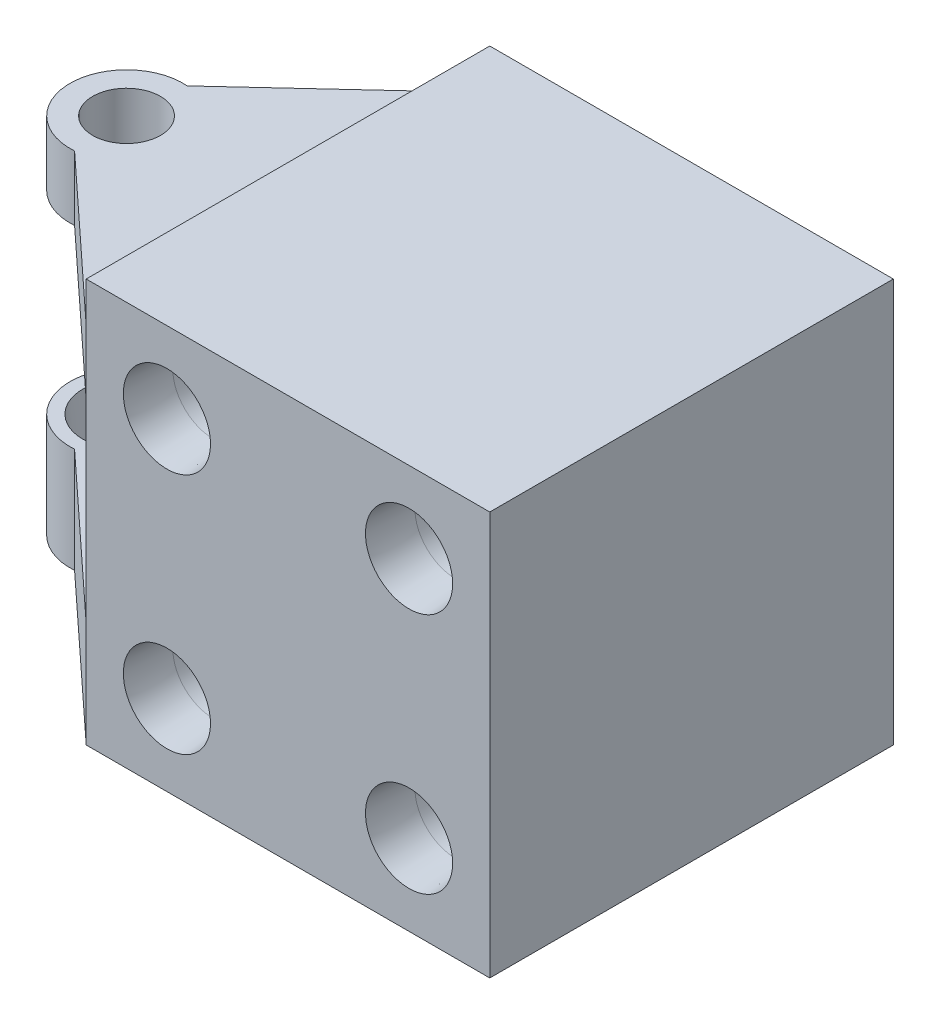
ISO-10303-21;
HEADER;
FILE_DESCRIPTION(('STEP AP214'),'2;1');
FILE_NAME('part.step','',(''),(''),'','','');
FILE_SCHEMA(('AUTOMOTIVE_DESIGN { 1 0 10303 214 1 1 1 1 }'));
ENDSEC;
DATA;
#1=APPLICATION_CONTEXT('core data for automotive mechanical design processes');
#2=APPLICATION_PROTOCOL_DEFINITION('international standard','automotive_design',2000,#1);
#3=PRODUCT_CONTEXT('',#1,'mechanical');
#4=PRODUCT('Part','Part','',(#3));
#5=PRODUCT_RELATED_PRODUCT_CATEGORY('part','',(#4));
#6=PRODUCT_DEFINITION_FORMATION('','',#4);
#7=PRODUCT_DEFINITION_CONTEXT('part definition',#1,'design');
#8=PRODUCT_DEFINITION('design','',#6,#7);
#9=PRODUCT_DEFINITION_SHAPE('','',#8);
#10=(LENGTH_UNIT() NAMED_UNIT(*) SI_UNIT(.MILLI.,.METRE.));
#11=(NAMED_UNIT(*) PLANE_ANGLE_UNIT() SI_UNIT($,.RADIAN.));
#12=(NAMED_UNIT(*) SI_UNIT($,.STERADIAN.) SOLID_ANGLE_UNIT());
#13=UNCERTAINTY_MEASURE_WITH_UNIT(LENGTH_MEASURE(1.E-05),#10,'distance_accuracy_value','');
#14=(GEOMETRIC_REPRESENTATION_CONTEXT(3) GLOBAL_UNCERTAINTY_ASSIGNED_CONTEXT((#13)) GLOBAL_UNIT_ASSIGNED_CONTEXT((#10,
#11,#12)) REPRESENTATION_CONTEXT('',''));
#15=CARTESIAN_POINT('',(0.,0.,0.));
#16=DIRECTION('',(0.,0.,1.));
#17=DIRECTION('',(1.,0.,0.));
#18=AXIS2_PLACEMENT_3D('',#15,#16,#17);
#19=CARTESIAN_POINT('',(-12.5,12.5,-12.5));
#20=DIRECTION('',(-1.,0.,0.));
#21=DIRECTION('',(0.,-1.,0.));
#22=AXIS2_PLACEMENT_3D('',#19,#20,#21);
#23=PLANE('',#22);
#24=DIRECTION('',(0.,-1.,0.));
#25=VECTOR('',#24,1.);
#26=CARTESIAN_POINT('',(-12.5,12.5,-12.5));
#27=LINE('',#26,#25);
#28=CARTESIAN_POINT('',(-12.5,12.5,-12.5));
#29=VERTEX_POINT('',#28);
#30=CARTESIAN_POINT('',(-12.5,10.,-12.5));
#31=VERTEX_POINT('',#30);
#32=EDGE_CURVE('E239',#29,#31,#27,.T.);
#33=ORIENTED_EDGE('',*,*,#32,.T.);
#34=DIRECTION('',(0.,0.,1.));
#35=VECTOR('',#34,1.);
#36=CARTESIAN_POINT('',(-12.5,10.,0.));
#37=LINE('',#36,#35);
#38=CARTESIAN_POINT('',(-12.5,10.,12.5));
#39=VERTEX_POINT('',#38);
#40=EDGE_CURVE('E176',#31,#39,#37,.T.);
#41=ORIENTED_EDGE('',*,*,#40,.T.);
#42=DIRECTION('',(0.,-1.,0.));
#43=VECTOR('',#42,1.);
#44=CARTESIAN_POINT('',(-12.5,12.5,12.5));
#45=LINE('',#44,#43);
#46=CARTESIAN_POINT('',(-12.5,12.5,12.5));
#47=VERTEX_POINT('',#46);
#48=EDGE_CURVE('E226',#47,#39,#45,.T.);
#49=ORIENTED_EDGE('',*,*,#48,.F.);
#50=DIRECTION('',(0.,0.,1.));
#51=VECTOR('',#50,1.);
#52=CARTESIAN_POINT('',(-12.5,12.5,-12.5));
#53=LINE('',#52,#51);
#54=EDGE_CURVE('E249',#29,#47,#53,.T.);
#55=ORIENTED_EDGE('',*,*,#54,.F.);
#56=EDGE_LOOP('',(#33,#41,#49,#55));
#57=FACE_BOUND('',#56,.T.);
#58=ADVANCED_FACE('F35',(#57),#23,.T.);
#59=CARTESIAN_POINT('',(7.49999999999999,-7.5,12.5));
#60=DIRECTION('',(0.,0.,1.));
#61=DIRECTION('',(1.,0.,0.));
#62=AXIS2_PLACEMENT_3D('',#59,#60,#61);
#63=CONICAL_SURFACE('',#62,2.7,0.0698131700797738);
#64=CARTESIAN_POINT('',(7.49999999999999,-7.5,9.63986674865748));
#65=DIRECTION('',(0.,0.,1.));
#66=DIRECTION('',(1.,0.,0.));
#67=AXIS2_PLACEMENT_3D('',#64,#65,#66);
#68=CIRCLE('',#67,2.49999999999999);
#69=CARTESIAN_POINT('',(9.99999999999998,-7.5,9.63986674865748));
#70=VERTEX_POINT('',#69);
#71=EDGE_CURVE('E11',#70,#70,#68,.T.);
#72=ORIENTED_EDGE('',*,*,#71,.F.);
#73=EDGE_LOOP('',(#72));
#74=FACE_BOUND('',#73,.T.);
#75=CARTESIAN_POINT('',(7.49999999999999,-7.5,12.5));
#76=DIRECTION('',(0.,0.,1.));
#77=DIRECTION('',(1.,0.,0.));
#78=AXIS2_PLACEMENT_3D('',#75,#76,#77);
#79=CIRCLE('',#78,2.7);
#80=CARTESIAN_POINT('',(10.2,-7.5,12.5));
#81=VERTEX_POINT('',#80);
#82=EDGE_CURVE('E260',#81,#81,#79,.T.);
#83=ORIENTED_EDGE('',*,*,#82,.T.);
#84=EDGE_LOOP('',(#83));
#85=FACE_BOUND('',#84,.T.);
#86=ADVANCED_FACE('F37',(#74,#85),#63,.F.);
#87=CARTESIAN_POINT('',(7.49999999999999,-7.5,12.5));
#88=DIRECTION('',(0.,0.,1.));
#89=DIRECTION('',(1.,0.,0.));
#90=AXIS2_PLACEMENT_3D('',#87,#88,#89);
#91=CYLINDRICAL_SURFACE('',#90,2.49999999999999);
#92=CARTESIAN_POINT('',(7.49999999999999,-7.5,2.50000000000001));
#93=DIRECTION('',(0.,0.,1.));
#94=DIRECTION('',(1.,0.,0.));
#95=AXIS2_PLACEMENT_3D('',#92,#93,#94);
#96=CIRCLE('',#95,2.49999999999999);
#97=CARTESIAN_POINT('',(9.99999999999998,-7.5,2.50000000000001));
#98=VERTEX_POINT('',#97);
#99=EDGE_CURVE('E44',#98,#98,#96,.T.);
#100=ORIENTED_EDGE('',*,*,#99,.F.);
#101=EDGE_LOOP('',(#100));
#102=FACE_BOUND('',#101,.T.);
#103=ORIENTED_EDGE('',*,*,#71,.T.);
#104=EDGE_LOOP('',(#103));
#105=FACE_BOUND('',#104,.T.);
#106=ADVANCED_FACE('F268',(#102,#105),#91,.F.);
#107=CARTESIAN_POINT('',(7.49999999999999,-7.5,2.50000000000001));
#108=DIRECTION('',(0.,0.,1.));
#109=DIRECTION('',(1.,0.,0.));
#110=AXIS2_PLACEMENT_3D('',#107,#108,#109);
#111=CONICAL_SURFACE('',#110,2.49999999999999,1.02974425867665);
#112=CARTESIAN_POINT('',(7.49999999999999,-7.5,0.997848452431099));
#113=VERTEX_POINT('',#112);
#114=VERTEX_LOOP('',#113);
#115=FACE_BOUND('',#114,.T.);
#116=ORIENTED_EDGE('',*,*,#99,.T.);
#117=EDGE_LOOP('',(#116));
#118=FACE_BOUND('',#117,.T.);
#119=ADVANCED_FACE('F266',(#115,#118),#111,.F.);
#120=CARTESIAN_POINT('',(7.49999999999999,7.5,12.5));
#121=DIRECTION('',(0.,0.,1.));
#122=DIRECTION('',(1.,0.,0.));
#123=AXIS2_PLACEMENT_3D('',#120,#121,#122);
#124=CONICAL_SURFACE('',#123,2.7,0.0698131700797738);
#125=CARTESIAN_POINT('',(7.49999999999999,7.5,9.63986674865748));
#126=DIRECTION('',(0.,0.,1.));
#127=DIRECTION('',(1.,0.,0.));
#128=AXIS2_PLACEMENT_3D('',#125,#126,#127);
#129=CIRCLE('',#128,2.49999999999999);
#130=CARTESIAN_POINT('',(9.99999999999998,7.5,9.63986674865748));
#131=VERTEX_POINT('',#130);
#132=EDGE_CURVE('E257',#131,#131,#129,.T.);
#133=ORIENTED_EDGE('',*,*,#132,.F.);
#134=EDGE_LOOP('',(#133));
#135=FACE_BOUND('',#134,.T.);
#136=CARTESIAN_POINT('',(7.49999999999999,7.5,12.5));
#137=DIRECTION('',(0.,0.,1.));
#138=DIRECTION('',(1.,0.,0.));
#139=AXIS2_PLACEMENT_3D('',#136,#137,#138);
#140=CIRCLE('',#139,2.7);
#141=CARTESIAN_POINT('',(10.2,7.5,12.5));
#142=VERTEX_POINT('',#141);
#143=EDGE_CURVE('E248',#142,#142,#140,.T.);
#144=ORIENTED_EDGE('',*,*,#143,.T.);
#145=EDGE_LOOP('',(#144));
#146=FACE_BOUND('',#145,.T.);
#147=ADVANCED_FACE('F567',(#135,#146),#124,.F.);
#148=CARTESIAN_POINT('',(7.49999999999999,7.5,12.5));
#149=DIRECTION('',(0.,0.,1.));
#150=DIRECTION('',(1.,0.,0.));
#151=AXIS2_PLACEMENT_3D('',#148,#149,#150);
#152=CYLINDRICAL_SURFACE('',#151,2.49999999999999);
#153=CARTESIAN_POINT('',(7.49999999999999,7.5,2.50000000000001));
#154=DIRECTION('',(0.,0.,1.));
#155=DIRECTION('',(1.,0.,0.));
#156=AXIS2_PLACEMENT_3D('',#153,#154,#155);
#157=CIRCLE('',#156,2.49999999999999);
#158=CARTESIAN_POINT('',(9.99999999999998,7.5,2.50000000000001));
#159=VERTEX_POINT('',#158);
#160=EDGE_CURVE('E254',#159,#159,#157,.T.);
#161=ORIENTED_EDGE('',*,*,#160,.F.);
#162=EDGE_LOOP('',(#161));
#163=FACE_BOUND('',#162,.T.);
#164=ORIENTED_EDGE('',*,*,#132,.T.);
#165=EDGE_LOOP('',(#164));
#166=FACE_BOUND('',#165,.T.);
#167=ADVANCED_FACE('F575',(#163,#166),#152,.F.);
#168=CARTESIAN_POINT('',(7.49999999999999,7.5,2.50000000000001));
#169=DIRECTION('',(0.,0.,1.));
#170=DIRECTION('',(1.,0.,0.));
#171=AXIS2_PLACEMENT_3D('',#168,#169,#170);
#172=CONICAL_SURFACE('',#171,2.49999999999999,1.02974425867665);
#173=CARTESIAN_POINT('',(7.49999999999999,7.5,0.997848452431099));
#174=VERTEX_POINT('',#173);
#175=VERTEX_LOOP('',#174);
#176=FACE_BOUND('',#175,.T.);
#177=ORIENTED_EDGE('',*,*,#160,.T.);
#178=EDGE_LOOP('',(#177));
#179=FACE_BOUND('',#178,.T.);
#180=ADVANCED_FACE('F584',(#176,#179),#172,.F.);
#181=CARTESIAN_POINT('',(12.5,12.5,-12.5));
#182=DIRECTION('',(1.,0.,0.));
#183=DIRECTION('',(0.,1.,0.));
#184=AXIS2_PLACEMENT_3D('',#181,#182,#183);
#185=PLANE('',#184);
#186=DIRECTION('',(0.,0.,1.));
#187=VECTOR('',#186,1.);
#188=CARTESIAN_POINT('',(12.5,12.5,-12.5));
#189=LINE('',#188,#187);
#190=CARTESIAN_POINT('',(12.5,12.5,-12.5));
#191=VERTEX_POINT('',#190);
#192=CARTESIAN_POINT('',(12.5,12.5,12.5));
#193=VERTEX_POINT('',#192);
#194=EDGE_CURVE('E245',#191,#193,#189,.T.);
#195=ORIENTED_EDGE('',*,*,#194,.T.);
#196=DIRECTION('',(0.,1.,0.));
#197=VECTOR('',#196,1.);
#198=CARTESIAN_POINT('',(12.5,12.5,12.5));
#199=LINE('',#198,#197);
#200=CARTESIAN_POINT('',(12.5,-12.5,12.5));
#201=VERTEX_POINT('',#200);
#202=EDGE_CURVE('E219',#201,#193,#199,.T.);
#203=ORIENTED_EDGE('',*,*,#202,.F.);
#204=DIRECTION('',(0.,0.,1.));
#205=VECTOR('',#204,1.);
#206=CARTESIAN_POINT('',(12.5,-12.5,-12.5));
#207=LINE('',#206,#205);
#208=CARTESIAN_POINT('',(12.5,-12.5,-12.5));
#209=VERTEX_POINT('',#208);
#210=EDGE_CURVE('E246',#209,#201,#207,.T.);
#211=ORIENTED_EDGE('',*,*,#210,.F.);
#212=DIRECTION('',(0.,1.,0.));
#213=VECTOR('',#212,1.);
#214=CARTESIAN_POINT('',(12.5,12.5,-12.5));
#215=LINE('',#214,#213);
#216=EDGE_CURVE('E232',#209,#191,#215,.T.);
#217=ORIENTED_EDGE('',*,*,#216,.T.);
#218=EDGE_LOOP('',(#195,#203,#211,#217));
#219=FACE_BOUND('',#218,.T.);
#220=ADVANCED_FACE('F315',(#219),#185,.T.);
#221=CARTESIAN_POINT('',(-12.5,-12.5,-12.5));
#222=DIRECTION('',(0.,-1.,0.));
#223=DIRECTION('',(0.,0.,-1.));
#224=AXIS2_PLACEMENT_3D('',#221,#222,#223);
#225=PLANE('',#224);
#226=CARTESIAN_POINT('',(-22.5,-12.5,0.));
#227=DIRECTION('',(0.,-1.,0.));
#228=DIRECTION('',(0.,0.,-1.));
#229=AXIS2_PLACEMENT_3D('',#226,#227,#228);
#230=CIRCLE('',#229,2.49999999999999);
#231=CARTESIAN_POINT('',(-22.5,-12.5,-2.49999999999999));
#232=VERTEX_POINT('',#231);
#233=EDGE_CURVE('E39',#232,#232,#230,.T.);
#234=ORIENTED_EDGE('',*,*,#233,.F.);
#235=EDGE_LOOP('',(#234));
#236=FACE_BOUND('',#235,.T.);
#237=ORIENTED_EDGE('',*,*,#210,.T.);
#238=DIRECTION('',(1.,0.,0.));
#239=VECTOR('',#238,1.);
#240=CARTESIAN_POINT('',(-12.5,-12.5,12.5));
#241=LINE('',#240,#239);
#242=CARTESIAN_POINT('',(-12.5,-12.5,12.5));
#243=VERTEX_POINT('',#242);
#244=EDGE_CURVE('E229',#243,#201,#241,.T.);
#245=ORIENTED_EDGE('',*,*,#244,.F.);
#246=DIRECTION('',(0.733760674018169,0.,0.679408031498305));
#247=VECTOR('',#246,1.);
#248=CARTESIAN_POINT('',(-12.0014771048745,-12.5,12.9615952732644));
#249=LINE('',#248,#247);
#250=CARTESIAN_POINT('',(-22.2311669128508,-12.5,3.48966026587888));
#251=VERTEX_POINT('',#250);
#252=EDGE_CURVE('E156',#251,#243,#249,.T.);
#253=ORIENTED_EDGE('',*,*,#252,.F.);
#254=CARTESIAN_POINT('',(-22.5,-12.5,0.));
#255=DIRECTION('',(0.,-1.,0.));
#256=DIRECTION('',(0.,0.,-1.));
#257=AXIS2_PLACEMENT_3D('',#254,#255,#256);
#258=CIRCLE('',#257,3.5);
#259=CARTESIAN_POINT('',(-22.2311669128508,-12.5,-3.48966026587888));
#260=VERTEX_POINT('',#259);
#261=EDGE_CURVE('E148',#260,#251,#258,.F.);
#262=ORIENTED_EDGE('',*,*,#261,.F.);
#263=DIRECTION('',(0.733760674018169,0.,-0.679408031498305));
#264=VECTOR('',#263,1.);
#265=CARTESIAN_POINT('',(-12.0014771048745,-12.5,-12.9615952732644));
#266=LINE('',#265,#264);
#267=CARTESIAN_POINT('',(-12.5,-12.5,-12.5));
#268=VERTEX_POINT('',#267);
#269=EDGE_CURVE('E135',#260,#268,#266,.T.);
#270=ORIENTED_EDGE('',*,*,#269,.T.);
#271=DIRECTION('',(1.,0.,0.));
#272=VECTOR('',#271,1.);
#273=CARTESIAN_POINT('',(-12.5,-12.5,-12.5));
#274=LINE('',#273,#272);
#275=EDGE_CURVE('E242',#268,#209,#274,.T.);
#276=ORIENTED_EDGE('',*,*,#275,.T.);
#277=EDGE_LOOP('',(#237,#245,#253,#262,#270,#276));
#278=FACE_BOUND('',#277,.T.);
#279=ADVANCED_FACE('F307',(#236,#278),#225,.T.);
#280=DIRECTION('',(0.,0.,1.));
#281=VECTOR('',#280,1.);
#282=CARTESIAN_POINT('',(-12.5,-6.,0.));
#283=LINE('',#282,#281);
#284=CARTESIAN_POINT('',(-12.5,-6.,-12.5));
#285=VERTEX_POINT('',#284);
#286=CARTESIAN_POINT('',(-12.5,-6.,12.5));
#287=VERTEX_POINT('',#286);
#288=EDGE_CURVE('E139',#285,#287,#283,.T.);
#289=ORIENTED_EDGE('',*,*,#288,.T.);
#290=CARTESIAN_POINT('',(-12.5,6.,12.5));
#291=VERTEX_POINT('',#290);
#292=EDGE_CURVE('E225',#291,#287,#45,.T.);
#293=ORIENTED_EDGE('',*,*,#292,.F.);
#294=DIRECTION('',(0.,0.,1.));
#295=VECTOR('',#294,1.);
#296=CARTESIAN_POINT('',(-12.5,6.,0.));
#297=LINE('',#296,#295);
#298=CARTESIAN_POINT('',(-12.5,6.,-12.5));
#299=VERTEX_POINT('',#298);
#300=EDGE_CURVE('E189',#299,#291,#297,.T.);
#301=ORIENTED_EDGE('',*,*,#300,.F.);
#302=EDGE_CURVE('E238',#299,#285,#27,.T.);
#303=ORIENTED_EDGE('',*,*,#302,.T.);
#304=EDGE_LOOP('',(#289,#293,#301,#303));
#305=FACE_BOUND('',#304,.T.);
#306=ADVANCED_FACE('F299',(#305),#23,.T.);
#307=CARTESIAN_POINT('',(-12.5,12.5,-12.5));
#308=DIRECTION('',(0.,1.,0.));
#309=DIRECTION('',(0.,0.,1.));
#310=AXIS2_PLACEMENT_3D('',#307,#308,#309);
#311=PLANE('',#310);
#312=ORIENTED_EDGE('',*,*,#54,.T.);
#313=DIRECTION('',(-1.,0.,0.));
#314=VECTOR('',#313,1.);
#315=CARTESIAN_POINT('',(-12.5,12.5,12.5));
#316=LINE('',#315,#314);
#317=EDGE_CURVE('E222',#193,#47,#316,.T.);
#318=ORIENTED_EDGE('',*,*,#317,.F.);
#319=ORIENTED_EDGE('',*,*,#194,.F.);
#320=DIRECTION('',(-1.,0.,0.));
#321=VECTOR('',#320,1.);
#322=CARTESIAN_POINT('',(-12.5,12.5,-12.5));
#323=LINE('',#322,#321);
#324=EDGE_CURVE('E235',#191,#29,#323,.T.);
#325=ORIENTED_EDGE('',*,*,#324,.T.);
#326=EDGE_LOOP('',(#312,#318,#319,#325));
#327=FACE_BOUND('',#326,.T.);
#328=ADVANCED_FACE('F291',(#327),#311,.T.);
#329=CARTESIAN_POINT('',(0.,0.,-12.5));
#330=DIRECTION('',(0.,0.,1.));
#331=DIRECTION('',(1.,0.,0.));
#332=AXIS2_PLACEMENT_3D('',#329,#330,#331);
#333=PLANE('',#332);
#334=ORIENTED_EDGE('',*,*,#216,.F.);
#335=ORIENTED_EDGE('',*,*,#275,.F.);
#336=DIRECTION('',(0.,1.,0.));
#337=VECTOR('',#336,1.);
#338=CARTESIAN_POINT('',(-12.5,-40.9121452903508,-12.5));
#339=LINE('',#338,#337);
#340=EDGE_CURVE('E164',#268,#285,#339,.T.);
#341=ORIENTED_EDGE('',*,*,#340,.T.);
#342=ORIENTED_EDGE('',*,*,#302,.F.);
#343=DIRECTION('',(0.,-1.,0.));
#344=VECTOR('',#343,1.);
#345=CARTESIAN_POINT('',(-12.5,10.,-12.5));
#346=LINE('',#345,#344);
#347=EDGE_CURVE('E182',#31,#299,#346,.T.);
#348=ORIENTED_EDGE('',*,*,#347,.F.);
#349=ORIENTED_EDGE('',*,*,#32,.F.);
#350=ORIENTED_EDGE('',*,*,#324,.F.);
#351=EDGE_LOOP('',(#334,#335,#341,#342,#348,#349,#350));
#352=FACE_BOUND('',#351,.T.);
#353=ADVANCED_FACE('F280',(#352),#333,.F.);
#354=CARTESIAN_POINT('',(0.,0.,12.5));
#355=DIRECTION('',(0.,0.,1.));
#356=DIRECTION('',(1.,0.,0.));
#357=AXIS2_PLACEMENT_3D('',#354,#355,#356);
#358=PLANE('',#357);
#359=CARTESIAN_POINT('',(-7.50000000000001,-7.5,12.5));
#360=DIRECTION('',(0.,0.,1.));
#361=DIRECTION('',(1.,0.,0.));
#362=AXIS2_PLACEMENT_3D('',#359,#360,#361);
#363=CIRCLE('',#362,2.7);
#364=CARTESIAN_POINT('',(-4.80000000000001,-7.5,12.5));
#365=VERTEX_POINT('',#364);
#366=EDGE_CURVE('E201',#365,#365,#363,.T.);
#367=ORIENTED_EDGE('',*,*,#366,.F.);
#368=EDGE_LOOP('',(#367));
#369=FACE_BOUND('',#368,.T.);
#370=CARTESIAN_POINT('',(-7.50000000000001,7.5,12.5));
#371=DIRECTION('',(0.,0.,1.));
#372=DIRECTION('',(1.,0.,0.));
#373=AXIS2_PLACEMENT_3D('',#370,#371,#372);
#374=CIRCLE('',#373,2.7);
#375=CARTESIAN_POINT('',(-4.80000000000001,7.5,12.5));
#376=VERTEX_POINT('',#375);
#377=EDGE_CURVE('E210',#376,#376,#374,.T.);
#378=ORIENTED_EDGE('',*,*,#377,.F.);
#379=EDGE_LOOP('',(#378));
#380=FACE_BOUND('',#379,.T.);
#381=ORIENTED_EDGE('',*,*,#202,.T.);
#382=ORIENTED_EDGE('',*,*,#317,.T.);
#383=ORIENTED_EDGE('',*,*,#48,.T.);
#384=DIRECTION('',(0.,-1.,0.));
#385=VECTOR('',#384,1.);
#386=CARTESIAN_POINT('',(-12.5,10.,12.5));
#387=LINE('',#386,#385);
#388=EDGE_CURVE('E51',#39,#291,#387,.T.);
#389=ORIENTED_EDGE('',*,*,#388,.T.);
#390=ORIENTED_EDGE('',*,*,#292,.T.);
#391=DIRECTION('',(0.,1.,0.));
#392=VECTOR('',#391,1.);
#393=CARTESIAN_POINT('',(-12.5,-40.9121452903508,12.5));
#394=LINE('',#393,#392);
#395=EDGE_CURVE('E162',#243,#287,#394,.T.);
#396=ORIENTED_EDGE('',*,*,#395,.F.);
#397=ORIENTED_EDGE('',*,*,#244,.T.);
#398=EDGE_LOOP('',(#381,#382,#383,#389,#390,#396,#397));
#399=FACE_BOUND('',#398,.T.);
#400=ORIENTED_EDGE('',*,*,#143,.F.);
#401=EDGE_LOOP('',(#400));
#402=FACE_BOUND('',#401,.T.);
#403=ORIENTED_EDGE('',*,*,#82,.F.);
#404=EDGE_LOOP('',(#403));
#405=FACE_BOUND('',#404,.T.);
#406=ADVANCED_FACE('F277',(#369,#380,#399,#402,#405),#358,.T.);
#407=CARTESIAN_POINT('',(-7.50000000000001,7.5,2.50000000000001));
#408=DIRECTION('',(0.,0.,1.));
#409=DIRECTION('',(1.,0.,0.));
#410=AXIS2_PLACEMENT_3D('',#407,#408,#409);
#411=CONICAL_SURFACE('',#410,2.49999999999999,1.02974425867665);
#412=CARTESIAN_POINT('',(-7.50000000000001,7.5,0.997848452431099));
#413=VERTEX_POINT('',#412);
#414=VERTEX_LOOP('',#413);
#415=FACE_BOUND('',#414,.T.);
#416=CARTESIAN_POINT('',(-7.50000000000001,7.5,2.50000000000001));
#417=DIRECTION('',(0.,0.,1.));
#418=DIRECTION('',(1.,0.,0.));
#419=AXIS2_PLACEMENT_3D('',#416,#417,#418);
#420=CIRCLE('',#419,2.49999999999999);
#421=CARTESIAN_POINT('',(-5.00000000000002,7.5,2.50000000000001));
#422=VERTEX_POINT('',#421);
#423=EDGE_CURVE('E216',#422,#422,#420,.T.);
#424=ORIENTED_EDGE('',*,*,#423,.T.);
#425=EDGE_LOOP('',(#424));
#426=FACE_BOUND('',#425,.T.);
#427=ADVANCED_FACE('F279',(#415,#426),#411,.F.);
#428=CARTESIAN_POINT('',(-7.50000000000001,7.5,12.5));
#429=DIRECTION('',(0.,0.,1.));
#430=DIRECTION('',(1.,0.,0.));
#431=AXIS2_PLACEMENT_3D('',#428,#429,#430);
#432=CYLINDRICAL_SURFACE('',#431,2.49999999999999);
#433=ORIENTED_EDGE('',*,*,#423,.F.);
#434=EDGE_LOOP('',(#433));
#435=FACE_BOUND('',#434,.T.);
#436=CARTESIAN_POINT('',(-7.50000000000001,7.5,9.63986674865748));
#437=DIRECTION('',(0.,0.,1.));
#438=DIRECTION('',(1.,0.,0.));
#439=AXIS2_PLACEMENT_3D('',#436,#437,#438);
#440=CIRCLE('',#439,2.49999999999999);
#441=CARTESIAN_POINT('',(-5.00000000000002,7.5,9.63986674865748));
#442=VERTEX_POINT('',#441);
#443=EDGE_CURVE('E213',#442,#442,#440,.T.);
#444=ORIENTED_EDGE('',*,*,#443,.T.);
#445=EDGE_LOOP('',(#444));
#446=FACE_BOUND('',#445,.T.);
#447=ADVANCED_FACE('F288',(#435,#446),#432,.F.);
#448=CARTESIAN_POINT('',(-7.50000000000001,7.5,12.5));
#449=DIRECTION('',(0.,0.,1.));
#450=DIRECTION('',(1.,0.,0.));
#451=AXIS2_PLACEMENT_3D('',#448,#449,#450);
#452=CONICAL_SURFACE('',#451,2.7,0.0698131700797738);
#453=ORIENTED_EDGE('',*,*,#443,.F.);
#454=EDGE_LOOP('',(#453));
#455=FACE_BOUND('',#454,.T.);
#456=ORIENTED_EDGE('',*,*,#377,.T.);
#457=EDGE_LOOP('',(#456));
#458=FACE_BOUND('',#457,.T.);
#459=ADVANCED_FACE('F375',(#455,#458),#452,.F.);
#460=CARTESIAN_POINT('',(-7.50000000000001,-7.5,2.50000000000001));
#461=DIRECTION('',(0.,0.,1.));
#462=DIRECTION('',(1.,0.,0.));
#463=AXIS2_PLACEMENT_3D('',#460,#461,#462);
#464=CONICAL_SURFACE('',#463,2.49999999999999,1.02974425867665);
#465=CARTESIAN_POINT('',(-7.50000000000001,-7.5,0.997848452431099));
#466=VERTEX_POINT('',#465);
#467=VERTEX_LOOP('',#466);
#468=FACE_BOUND('',#467,.T.);
#469=CARTESIAN_POINT('',(-7.50000000000001,-7.5,2.50000000000001));
#470=DIRECTION('',(0.,0.,1.));
#471=DIRECTION('',(1.,0.,0.));
#472=AXIS2_PLACEMENT_3D('',#469,#470,#471);
#473=CIRCLE('',#472,2.49999999999999);
#474=CARTESIAN_POINT('',(-5.00000000000002,-7.5,2.50000000000001));
#475=VERTEX_POINT('',#474);
#476=EDGE_CURVE('E207',#475,#475,#473,.T.);
#477=ORIENTED_EDGE('',*,*,#476,.T.);
#478=EDGE_LOOP('',(#477));
#479=FACE_BOUND('',#478,.T.);
#480=ADVANCED_FACE('F371',(#468,#479),#464,.F.);
#481=CARTESIAN_POINT('',(-7.50000000000001,-7.5,12.5));
#482=DIRECTION('',(0.,0.,1.));
#483=DIRECTION('',(1.,0.,0.));
#484=AXIS2_PLACEMENT_3D('',#481,#482,#483);
#485=CYLINDRICAL_SURFACE('',#484,2.49999999999999);
#486=ORIENTED_EDGE('',*,*,#476,.F.);
#487=EDGE_LOOP('',(#486));
#488=FACE_BOUND('',#487,.T.);
#489=CARTESIAN_POINT('',(-7.50000000000001,-7.5,9.63986674865748));
#490=DIRECTION('',(0.,0.,1.));
#491=DIRECTION('',(1.,0.,0.));
#492=AXIS2_PLACEMENT_3D('',#489,#490,#491);
#493=CIRCLE('',#492,2.49999999999999);
#494=CARTESIAN_POINT('',(-5.00000000000002,-7.5,9.63986674865748));
#495=VERTEX_POINT('',#494);
#496=EDGE_CURVE('E204',#495,#495,#493,.T.);
#497=ORIENTED_EDGE('',*,*,#496,.T.);
#498=EDGE_LOOP('',(#497));
#499=FACE_BOUND('',#498,.T.);
#500=ADVANCED_FACE('F367',(#488,#499),#485,.F.);
#501=CARTESIAN_POINT('',(-7.50000000000001,-7.5,12.5));
#502=DIRECTION('',(0.,0.,1.));
#503=DIRECTION('',(1.,0.,0.));
#504=AXIS2_PLACEMENT_3D('',#501,#502,#503);
#505=CONICAL_SURFACE('',#504,2.7,0.0698131700797738);
#506=ORIENTED_EDGE('',*,*,#496,.F.);
#507=EDGE_LOOP('',(#506));
#508=FACE_BOUND('',#507,.T.);
#509=ORIENTED_EDGE('',*,*,#366,.T.);
#510=EDGE_LOOP('',(#509));
#511=FACE_BOUND('',#510,.T.);
#512=ADVANCED_FACE('F364',(#508,#511),#505,.F.);
#513=CARTESIAN_POINT('',(-12.0014771048745,10.,-12.9615952732644));
#514=DIRECTION('',(-0.679408031498305,0.,-0.733760674018169));
#515=DIRECTION('',(-0.733760674018169,0.,0.679408031498305));
#516=AXIS2_PLACEMENT_3D('',#513,#514,#515);
#517=PLANE('',#516);
#518=DIRECTION('',(0.733760674018169,0.,-0.679408031498305));
#519=VECTOR('',#518,1.);
#520=CARTESIAN_POINT('',(-12.0014771048745,6.,-12.9615952732644));
#521=LINE('',#520,#519);
#522=CARTESIAN_POINT('',(-22.2311669128508,6.,-3.48966026587888));
#523=VERTEX_POINT('',#522);
#524=EDGE_CURVE('E168',#523,#299,#521,.T.);
#525=ORIENTED_EDGE('',*,*,#524,.F.);
#526=DIRECTION('',(0.,-1.,0.));
#527=VECTOR('',#526,1.);
#528=CARTESIAN_POINT('',(-22.2311669128508,10.,-3.48966026587888));
#529=LINE('',#528,#527);
#530=CARTESIAN_POINT('',(-22.2311669128508,10.,-3.48966026587888));
#531=VERTEX_POINT('',#530);
#532=EDGE_CURVE('E199',#531,#523,#529,.T.);
#533=ORIENTED_EDGE('',*,*,#532,.F.);
#534=DIRECTION('',(0.733760674018169,0.,-0.679408031498305));
#535=VECTOR('',#534,1.);
#536=CARTESIAN_POINT('',(-12.0014771048745,10.,-12.9615952732644));
#537=LINE('',#536,#535);
#538=EDGE_CURVE('E169',#531,#31,#537,.T.);
#539=ORIENTED_EDGE('',*,*,#538,.T.);
#540=ORIENTED_EDGE('',*,*,#347,.T.);
#541=EDGE_LOOP('',(#525,#533,#539,#540));
#542=FACE_BOUND('',#541,.T.);
#543=ADVANCED_FACE('F339',(#542),#517,.T.);
#544=CARTESIAN_POINT('',(-22.5,10.,0.));
#545=DIRECTION('',(0.,-1.,0.));
#546=DIRECTION('',(0.,0.,-1.));
#547=AXIS2_PLACEMENT_3D('',#544,#545,#546);
#548=CYLINDRICAL_SURFACE('',#547,3.5);
#549=CARTESIAN_POINT('',(-22.5,6.,0.));
#550=DIRECTION('',(0.,1.,0.));
#551=DIRECTION('',(0.,0.,1.));
#552=AXIS2_PLACEMENT_3D('',#549,#550,#551);
#553=CIRCLE('',#552,3.5);
#554=CARTESIAN_POINT('',(-22.2311669128508,6.,3.48966026587888));
#555=VERTEX_POINT('',#554);
#556=EDGE_CURVE('E185',#523,#555,#553,.T.);
#557=ORIENTED_EDGE('',*,*,#556,.T.);
#558=DIRECTION('',(0.,-1.,0.));
#559=VECTOR('',#558,1.);
#560=CARTESIAN_POINT('',(-22.2311669128508,10.,3.48966026587888));
#561=LINE('',#560,#559);
#562=CARTESIAN_POINT('',(-22.2311669128508,10.,3.48966026587888));
#563=VERTEX_POINT('',#562);
#564=EDGE_CURVE('E196',#563,#555,#561,.T.);
#565=ORIENTED_EDGE('',*,*,#564,.F.);
#566=CARTESIAN_POINT('',(-22.5,10.,0.));
#567=DIRECTION('',(0.,1.,0.));
#568=DIRECTION('',(0.,0.,1.));
#569=AXIS2_PLACEMENT_3D('',#566,#567,#568);
#570=CIRCLE('',#569,3.5);
#571=EDGE_CURVE('E171',#531,#563,#570,.T.);
#572=ORIENTED_EDGE('',*,*,#571,.F.);
#573=ORIENTED_EDGE('',*,*,#532,.T.);
#574=EDGE_LOOP('',(#557,#565,#572,#573));
#575=FACE_BOUND('',#574,.T.);
#576=ADVANCED_FACE('F347',(#575),#548,.T.);
#577=CARTESIAN_POINT('',(-12.0014771048745,10.,12.9615952732644));
#578=DIRECTION('',(0.679408031498305,0.,-0.733760674018169));
#579=DIRECTION('',(-0.733760674018169,0.,-0.679408031498305));
#580=AXIS2_PLACEMENT_3D('',#577,#578,#579);
#581=PLANE('',#580);
#582=DIRECTION('',(0.733760674018169,0.,0.679408031498305));
#583=VECTOR('',#582,1.);
#584=CARTESIAN_POINT('',(-12.0014771048745,6.,12.9615952732644));
#585=LINE('',#584,#583);
#586=EDGE_CURVE('E187',#555,#291,#585,.T.);
#587=ORIENTED_EDGE('',*,*,#586,.T.);
#588=ORIENTED_EDGE('',*,*,#388,.F.);
#589=DIRECTION('',(0.733760674018169,0.,0.679408031498305));
#590=VECTOR('',#589,1.);
#591=CARTESIAN_POINT('',(-12.0014771048745,10.,12.9615952732644));
#592=LINE('',#591,#590);
#593=EDGE_CURVE('E174',#563,#39,#592,.T.);
#594=ORIENTED_EDGE('',*,*,#593,.F.);
#595=ORIENTED_EDGE('',*,*,#564,.T.);
#596=EDGE_LOOP('',(#587,#588,#594,#595));
#597=FACE_BOUND('',#596,.T.);
#598=ADVANCED_FACE('F349',(#597),#581,.F.);
#599=CARTESIAN_POINT('',(-22.5,10.,0.));
#600=DIRECTION('',(0.,-1.,0.));
#601=DIRECTION('',(0.,0.,-1.));
#602=AXIS2_PLACEMENT_3D('',#599,#600,#601);
#603=CYLINDRICAL_SURFACE('',#602,2.1);
#604=CARTESIAN_POINT('',(-22.5,10.,0.));
#605=DIRECTION('',(0.,1.,0.));
#606=DIRECTION('',(0.,0.,1.));
#607=AXIS2_PLACEMENT_3D('',#604,#605,#606);
#608=CIRCLE('',#607,2.1);
#609=CARTESIAN_POINT('',(-22.5,10.,2.1));
#610=VERTEX_POINT('',#609);
#611=EDGE_CURVE('E179',#610,#610,#608,.T.);
#612=ORIENTED_EDGE('',*,*,#611,.T.);
#613=EDGE_LOOP('',(#612));
#614=FACE_BOUND('',#613,.T.);
#615=CARTESIAN_POINT('',(-22.5,6.,0.));
#616=DIRECTION('',(0.,1.,0.));
#617=DIRECTION('',(0.,0.,1.));
#618=AXIS2_PLACEMENT_3D('',#615,#616,#617);
#619=CIRCLE('',#618,2.1);
#620=CARTESIAN_POINT('',(-22.5,6.,2.1));
#621=VERTEX_POINT('',#620);
#622=EDGE_CURVE('E172',#621,#621,#619,.T.);
#623=ORIENTED_EDGE('',*,*,#622,.F.);
#624=EDGE_LOOP('',(#623));
#625=FACE_BOUND('',#624,.T.);
#626=ADVANCED_FACE('F351',(#614,#625),#603,.F.);
#627=CARTESIAN_POINT('',(0.,10.,0.));
#628=DIRECTION('',(0.,1.,0.));
#629=DIRECTION('',(0.,0.,1.));
#630=AXIS2_PLACEMENT_3D('',#627,#628,#629);
#631=PLANE('',#630);
#632=ORIENTED_EDGE('',*,*,#538,.F.);
#633=ORIENTED_EDGE('',*,*,#571,.T.);
#634=ORIENTED_EDGE('',*,*,#593,.T.);
#635=ORIENTED_EDGE('',*,*,#40,.F.);
#636=EDGE_LOOP('',(#632,#633,#634,#635));
#637=FACE_BOUND('',#636,.T.);
#638=ORIENTED_EDGE('',*,*,#611,.F.);
#639=EDGE_LOOP('',(#638));
#640=FACE_BOUND('',#639,.T.);
#641=ADVANCED_FACE('F333',(#637,#640),#631,.T.);
#642=CARTESIAN_POINT('',(0.,6.,0.));
#643=DIRECTION('',(0.,1.,0.));
#644=DIRECTION('',(0.,0.,1.));
#645=AXIS2_PLACEMENT_3D('',#642,#643,#644);
#646=PLANE('',#645);
#647=ORIENTED_EDGE('',*,*,#524,.T.);
#648=ORIENTED_EDGE('',*,*,#300,.T.);
#649=ORIENTED_EDGE('',*,*,#586,.F.);
#650=ORIENTED_EDGE('',*,*,#556,.F.);
#651=EDGE_LOOP('',(#647,#648,#649,#650));
#652=FACE_BOUND('',#651,.T.);
#653=ORIENTED_EDGE('',*,*,#622,.T.);
#654=EDGE_LOOP('',(#653));
#655=FACE_BOUND('',#654,.T.);
#656=ADVANCED_FACE('F342',(#652,#655),#646,.F.);
#657=CARTESIAN_POINT('',(0.,-6.,0.));
#658=DIRECTION('',(0.,1.,0.));
#659=DIRECTION('',(0.,0.,1.));
#660=AXIS2_PLACEMENT_3D('',#657,#658,#659);
#661=PLANE('',#660);
#662=CARTESIAN_POINT('',(-22.5,-6.,0.));
#663=DIRECTION('',(0.,1.,0.));
#664=DIRECTION('',(0.,0.,1.));
#665=AXIS2_PLACEMENT_3D('',#662,#663,#664);
#666=CIRCLE('',#665,2.7);
#667=CARTESIAN_POINT('',(-22.5,-6.,2.7));
#668=VERTEX_POINT('',#667);
#669=EDGE_CURVE('E627',#668,#668,#666,.T.);
#670=ORIENTED_EDGE('',*,*,#669,.F.);
#671=EDGE_LOOP('',(#670));
#672=FACE_BOUND('',#671,.T.);
#673=CARTESIAN_POINT('',(-22.5,-6.,0.));
#674=DIRECTION('',(0.,1.,0.));
#675=DIRECTION('',(0.,0.,1.));
#676=AXIS2_PLACEMENT_3D('',#673,#674,#675);
#677=CIRCLE('',#676,3.5);
#678=CARTESIAN_POINT('',(-22.2311669128508,-6.,-3.48966026587888));
#679=VERTEX_POINT('',#678);
#680=CARTESIAN_POINT('',(-22.2311669128508,-6.,3.48966026587888));
#681=VERTEX_POINT('',#680);
#682=EDGE_CURVE('E145',#679,#681,#677,.T.);
#683=ORIENTED_EDGE('',*,*,#682,.T.);
#684=DIRECTION('',(0.733760674018169,0.,0.679408031498305));
#685=VECTOR('',#684,1.);
#686=CARTESIAN_POINT('',(-12.0014771048745,-6.,12.9615952732644));
#687=LINE('',#686,#685);
#688=EDGE_CURVE('E154',#681,#287,#687,.T.);
#689=ORIENTED_EDGE('',*,*,#688,.T.);
#690=ORIENTED_EDGE('',*,*,#288,.F.);
#691=DIRECTION('',(0.733760674018169,0.,-0.679408031498305));
#692=VECTOR('',#691,1.);
#693=CARTESIAN_POINT('',(-12.0014771048745,-6.,-12.9615952732644));
#694=LINE('',#693,#692);
#695=EDGE_CURVE('E133',#679,#285,#694,.T.);
#696=ORIENTED_EDGE('',*,*,#695,.F.);
#697=EDGE_LOOP('',(#683,#689,#690,#696));
#698=FACE_BOUND('',#697,.T.);
#699=ADVANCED_FACE('F143',(#672,#698),#661,.T.);
#700=CARTESIAN_POINT('',(-12.0014771048745,-40.9121452903508,12.9615952732644));
#701=DIRECTION('',(-0.679408031498305,0.,0.733760674018169));
#702=DIRECTION('',(0.733760674018169,0.,0.679408031498305));
#703=AXIS2_PLACEMENT_3D('',#700,#701,#702);
#704=PLANE('',#703);
#705=DIRECTION('',(0.,1.,0.));
#706=VECTOR('',#705,1.);
#707=CARTESIAN_POINT('',(-22.2311669128508,-40.9121452903508,3.48966026587888));
#708=LINE('',#707,#706);
#709=EDGE_CURVE('E152',#251,#681,#708,.T.);
#710=ORIENTED_EDGE('',*,*,#709,.F.);
#711=ORIENTED_EDGE('',*,*,#252,.T.);
#712=ORIENTED_EDGE('',*,*,#395,.T.);
#713=ORIENTED_EDGE('',*,*,#688,.F.);
#714=EDGE_LOOP('',(#710,#711,#712,#713));
#715=FACE_BOUND('',#714,.T.);
#716=ADVANCED_FACE('F461',(#715),#704,.T.);
#717=CARTESIAN_POINT('',(-12.0014771048745,-40.9121452903508,-12.9615952732644));
#718=DIRECTION('',(0.679408031498305,0.,0.733760674018169));
#719=DIRECTION('',(0.733760674018169,0.,-0.679408031498305));
#720=AXIS2_PLACEMENT_3D('',#717,#718,#719);
#721=PLANE('',#720);
#722=ORIENTED_EDGE('',*,*,#269,.F.);
#723=DIRECTION('',(0.,1.,0.));
#724=VECTOR('',#723,1.);
#725=CARTESIAN_POINT('',(-22.2311669128508,-40.9121452903508,-3.48966026587888));
#726=LINE('',#725,#724);
#727=EDGE_CURVE('E129',#260,#679,#726,.T.);
#728=ORIENTED_EDGE('',*,*,#727,.T.);
#729=ORIENTED_EDGE('',*,*,#695,.T.);
#730=ORIENTED_EDGE('',*,*,#340,.F.);
#731=EDGE_LOOP('',(#722,#728,#729,#730));
#732=FACE_BOUND('',#731,.T.);
#733=ADVANCED_FACE('F131',(#732),#721,.F.);
#734=CARTESIAN_POINT('',(-22.5,-40.9121452903508,0.));
#735=DIRECTION('',(0.,1.,0.));
#736=DIRECTION('',(0.,0.,1.));
#737=AXIS2_PLACEMENT_3D('',#734,#735,#736);
#738=CYLINDRICAL_SURFACE('',#737,3.5);
#739=ORIENTED_EDGE('',*,*,#727,.F.);
#740=ORIENTED_EDGE('',*,*,#261,.T.);
#741=ORIENTED_EDGE('',*,*,#709,.T.);
#742=ORIENTED_EDGE('',*,*,#682,.F.);
#743=EDGE_LOOP('',(#739,#740,#741,#742));
#744=FACE_BOUND('',#743,.T.);
#745=ADVANCED_FACE('F150',(#744),#738,.T.);
#746=CARTESIAN_POINT('',(-22.5,-6.,0.));
#747=DIRECTION('',(0.,1.,0.));
#748=DIRECTION('',(0.,0.,1.));
#749=AXIS2_PLACEMENT_3D('',#746,#747,#748);
#750=CYLINDRICAL_SURFACE('',#749,2.49999999999999);
#751=ORIENTED_EDGE('',*,*,#233,.T.);
#752=EDGE_LOOP('',(#751));
#753=FACE_BOUND('',#752,.T.);
#754=CARTESIAN_POINT('',(-22.5,-8.86013325134252,0.));
#755=DIRECTION('',(0.,1.,0.));
#756=DIRECTION('',(0.,0.,1.));
#757=AXIS2_PLACEMENT_3D('',#754,#755,#756);
#758=CIRCLE('',#757,2.49999999999999);
#759=CARTESIAN_POINT('',(-22.5,-8.86013325134252,2.49999999999998));
#760=VERTEX_POINT('',#759);
#761=EDGE_CURVE('E624',#760,#760,#758,.T.);
#762=ORIENTED_EDGE('',*,*,#761,.T.);
#763=EDGE_LOOP('',(#762));
#764=FACE_BOUND('',#763,.T.);
#765=ADVANCED_FACE('F481',(#753,#764),#750,.F.);
#766=CARTESIAN_POINT('',(-22.5,-6.,0.));
#767=DIRECTION('',(0.,1.,0.));
#768=DIRECTION('',(0.,0.,1.));
#769=AXIS2_PLACEMENT_3D('',#766,#767,#768);
#770=CONICAL_SURFACE('',#769,2.7,0.0698131700797743);
#771=ORIENTED_EDGE('',*,*,#761,.F.);
#772=EDGE_LOOP('',(#771));
#773=FACE_BOUND('',#772,.T.);
#774=ORIENTED_EDGE('',*,*,#669,.T.);
#775=EDGE_LOOP('',(#774));
#776=FACE_BOUND('',#775,.T.);
#777=ADVANCED_FACE('F487',(#773,#776),#770,.F.);
#778=CLOSED_SHELL('',(#58,#86,#106,#119,#147,#167,#180,#220,#279,#306,#328,#353,#406,#427,#447,
#459,#480,#500,#512,#543,#576,#598,#626,#641,#656,#699,#716,#733,#745,#765,#777));
#779=MANIFOLD_SOLID_BREP('B2',#778);
#780=ADVANCED_BREP_SHAPE_REPRESENTATION('',(#18,#779),#14);
#781=SHAPE_DEFINITION_REPRESENTATION(#9,#780);
ENDSEC;
END-ISO-10303-21;
